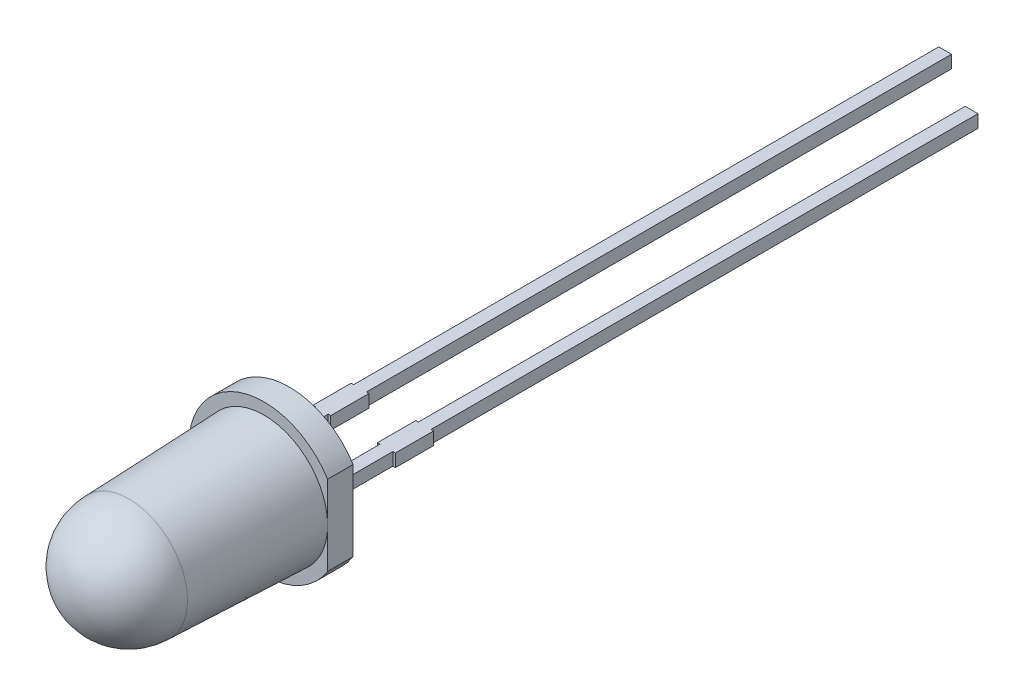
ISO-10303-21;
HEADER;
FILE_DESCRIPTION(('STEP AP214'),'2;1');
FILE_NAME('part.step','',(''),(''),'','','');
FILE_SCHEMA(('AUTOMOTIVE_DESIGN { 1 0 10303 214 1 1 1 1 }'));
ENDSEC;
DATA;
#1=APPLICATION_CONTEXT('core data for automotive mechanical design processes');
#2=APPLICATION_PROTOCOL_DEFINITION('international standard','automotive_design',2000,#1);
#3=PRODUCT_CONTEXT('',#1,'mechanical');
#4=PRODUCT('Part','Part','',(#3));
#5=PRODUCT_RELATED_PRODUCT_CATEGORY('part','',(#4));
#6=PRODUCT_DEFINITION_FORMATION('','',#4);
#7=PRODUCT_DEFINITION_CONTEXT('part definition',#1,'design');
#8=PRODUCT_DEFINITION('design','',#6,#7);
#9=PRODUCT_DEFINITION_SHAPE('','',#8);
#10=(LENGTH_UNIT() NAMED_UNIT(*) SI_UNIT(.MILLI.,.METRE.));
#11=(NAMED_UNIT(*) PLANE_ANGLE_UNIT() SI_UNIT($,.RADIAN.));
#12=(NAMED_UNIT(*) SI_UNIT($,.STERADIAN.) SOLID_ANGLE_UNIT());
#13=UNCERTAINTY_MEASURE_WITH_UNIT(LENGTH_MEASURE(1.E-05),#10,'distance_accuracy_value','');
#14=(GEOMETRIC_REPRESENTATION_CONTEXT(3) GLOBAL_UNCERTAINTY_ASSIGNED_CONTEXT((#13)) GLOBAL_UNIT_ASSIGNED_CONTEXT((#10,
#11,#12)) REPRESENTATION_CONTEXT('',''));
#15=CARTESIAN_POINT('',(0.,0.,0.));
#16=DIRECTION('',(0.,0.,1.));
#17=DIRECTION('',(1.,0.,0.));
#18=AXIS2_PLACEMENT_3D('',#15,#16,#17);
#19=CARTESIAN_POINT('',(0.,0.,6.3));
#20=DIRECTION('',(0.,0.,-1.));
#21=DIRECTION('',(-1.,0.,0.));
#22=AXIS2_PLACEMENT_3D('',#19,#20,#21);
#23=SPHERICAL_SURFACE('',#22,2.3);
#24=CARTESIAN_POINT('',(0.,0.,6.3));
#25=DIRECTION('',(0.,0.,1.));
#26=DIRECTION('',(-1.,0.,0.));
#27=AXIS2_PLACEMENT_3D('',#24,#25,#26);
#28=CIRCLE('',#27,2.3);
#29=CARTESIAN_POINT('',(2.3,0.,6.3));
#30=VERTEX_POINT('',#29);
#31=CARTESIAN_POINT('',(-2.3,0.,6.3));
#32=VERTEX_POINT('',#31);
#33=EDGE_CURVE('E10',#30,#32,#28,.T.);
#34=ORIENTED_EDGE('',*,*,#33,.T.);
#35=CARTESIAN_POINT('',(0.,0.,6.3));
#36=DIRECTION('',(0.,0.,1.));
#37=DIRECTION('',(1.,0.,0.));
#38=AXIS2_PLACEMENT_3D('',#35,#36,#37);
#39=CIRCLE('',#38,2.3);
#40=EDGE_CURVE('E26',#32,#30,#39,.T.);
#41=ORIENTED_EDGE('',*,*,#40,.T.);
#42=EDGE_LOOP('',(#34,#41));
#43=FACE_BOUND('',#42,.T.);
#44=ADVANCED_FACE('F15',(#43),#23,.T.);
#45=CARTESIAN_POINT('',(0.,0.,3.65));
#46=DIRECTION('',(0.,0.,-1.));
#47=DIRECTION('',(1.,0.,0.));
#48=AXIS2_PLACEMENT_3D('',#45,#46,#47);
#49=CONICAL_SURFACE('',#48,2.4,0.0377179524668634);
#50=ORIENTED_EDGE('',*,*,#40,.F.);
#51=ORIENTED_EDGE('',*,*,#33,.F.);
#52=EDGE_LOOP('',(#50,#51));
#53=FACE_BOUND('',#52,.T.);
#54=CARTESIAN_POINT('',(0.,0.,1.));
#55=DIRECTION('',(0.,0.,1.));
#56=DIRECTION('',(1.,0.,0.));
#57=AXIS2_PLACEMENT_3D('',#54,#55,#56);
#58=CIRCLE('',#57,2.5);
#59=CARTESIAN_POINT('',(2.5,0.,1.));
#60=VERTEX_POINT('',#59);
#61=EDGE_CURVE('E400',#60,#60,#58,.T.);
#62=ORIENTED_EDGE('',*,*,#61,.T.);
#63=EDGE_LOOP('',(#62));
#64=FACE_BOUND('',#63,.T.);
#65=ADVANCED_FACE('F965',(#53,#64),#49,.T.);
#66=CARTESIAN_POINT('',(0.,0.,1.));
#67=DIRECTION('',(0.,0.,1.));
#68=DIRECTION('',(1.,0.,0.));
#69=AXIS2_PLACEMENT_3D('',#66,#67,#68);
#70=PLANE('',#69);
#71=ORIENTED_EDGE('',*,*,#61,.F.);
#72=DIRECTION('',(0.,1.,0.));
#73=VECTOR('',#72,1.);
#74=CARTESIAN_POINT('',(2.5,0.,1.));
#75=LINE('',#74,#73);
#76=CARTESIAN_POINT('',(2.5,1.56604597633658,1.));
#77=VERTEX_POINT('',#76);
#78=EDGE_CURVE('E376',#60,#77,#75,.T.);
#79=ORIENTED_EDGE('',*,*,#78,.T.);
#80=CARTESIAN_POINT('',(0.,0.,1.));
#81=DIRECTION('',(0.,0.,1.));
#82=DIRECTION('',(0.847457627118644,0.53086304282596,0.));
#83=AXIS2_PLACEMENT_3D('',#80,#81,#82);
#84=CIRCLE('',#83,2.95);
#85=CARTESIAN_POINT('',(2.5,-1.56604597633658,1.));
#86=VERTEX_POINT('',#85);
#87=EDGE_CURVE('E371',#77,#86,#84,.T.);
#88=ORIENTED_EDGE('',*,*,#87,.T.);
#89=DIRECTION('',(0.,1.,0.));
#90=VECTOR('',#89,1.);
#91=CARTESIAN_POINT('',(2.5,-1.56604597633658,1.));
#92=LINE('',#91,#90);
#93=EDGE_CURVE('E248',#86,#60,#92,.T.);
#94=ORIENTED_EDGE('',*,*,#93,.T.);
#95=EDGE_LOOP('',(#71,#79,#88,#94));
#96=FACE_BOUND('',#95,.T.);
#97=ADVANCED_FACE('F17',(#96),#70,.T.);
#98=CARTESIAN_POINT('',(-1.02,-0.25,-2.54));
#99=DIRECTION('',(0.,0.,1.));
#100=DIRECTION('',(1.,0.,0.));
#101=AXIS2_PLACEMENT_3D('',#98,#99,#100);
#102=PLANE('',#101);
#103=DIRECTION('',(1.,0.,0.));
#104=VECTOR('',#103,1.);
#105=CARTESIAN_POINT('',(-1.02,-0.25,-2.54));
#106=LINE('',#105,#104);
#107=CARTESIAN_POINT('',(-1.02,-0.25,-2.54));
#108=VERTEX_POINT('',#107);
#109=CARTESIAN_POINT('',(-0.92,-0.25,-2.54));
#110=VERTEX_POINT('',#109);
#111=EDGE_CURVE('E353',#108,#110,#106,.T.);
#112=ORIENTED_EDGE('',*,*,#111,.T.);
#113=DIRECTION('',(0.,1.,0.));
#114=VECTOR('',#113,1.);
#115=CARTESIAN_POINT('',(-0.92,-0.25,-2.54));
#116=LINE('',#115,#114);
#117=CARTESIAN_POINT('',(-0.92,0.25,-2.54));
#118=VERTEX_POINT('',#117);
#119=EDGE_CURVE('E347',#110,#118,#116,.T.);
#120=ORIENTED_EDGE('',*,*,#119,.T.);
#121=DIRECTION('',(1.,0.,0.));
#122=VECTOR('',#121,1.);
#123=CARTESIAN_POINT('',(-1.02,0.25,-2.54));
#124=LINE('',#123,#122);
#125=CARTESIAN_POINT('',(-1.02,0.25,-2.54));
#126=VERTEX_POINT('',#125);
#127=EDGE_CURVE('E342',#126,#118,#124,.T.);
#128=ORIENTED_EDGE('',*,*,#127,.F.);
#129=DIRECTION('',(0.,1.,0.));
#130=VECTOR('',#129,1.);
#131=CARTESIAN_POINT('',(-1.02,-0.25,-2.54));
#132=LINE('',#131,#130);
#133=EDGE_CURVE('E19',#108,#126,#132,.T.);
#134=ORIENTED_EDGE('',*,*,#133,.F.);
#135=EDGE_LOOP('',(#112,#120,#128,#134));
#136=FACE_BOUND('',#135,.T.);
#137=ADVANCED_FACE('F1058',(#136),#102,.T.);
#138=CARTESIAN_POINT('',(-0.92,-0.25,-2.54));
#139=DIRECTION('',(1.,0.,0.));
#140=DIRECTION('',(0.,1.,0.));
#141=AXIS2_PLACEMENT_3D('',#138,#139,#140);
#142=PLANE('',#141);
#143=DIRECTION('',(0.,0.,-1.));
#144=VECTOR('',#143,1.);
#145=CARTESIAN_POINT('',(-0.92,-0.25,-2.54));
#146=LINE('',#145,#144);
#147=CARTESIAN_POINT('',(-0.92,-0.25,-4.04));
#148=VERTEX_POINT('',#147);
#149=EDGE_CURVE('E349',#110,#148,#146,.T.);
#150=ORIENTED_EDGE('',*,*,#149,.T.);
#151=DIRECTION('',(0.,1.,0.));
#152=VECTOR('',#151,1.);
#153=CARTESIAN_POINT('',(-0.92,-0.25,-4.04));
#154=LINE('',#153,#152);
#155=CARTESIAN_POINT('',(-0.92,0.25,-4.04));
#156=VERTEX_POINT('',#155);
#157=EDGE_CURVE('E344',#148,#156,#154,.T.);
#158=ORIENTED_EDGE('',*,*,#157,.T.);
#159=DIRECTION('',(0.,0.,-1.));
#160=VECTOR('',#159,1.);
#161=CARTESIAN_POINT('',(-0.92,0.25,-2.54));
#162=LINE('',#161,#160);
#163=EDGE_CURVE('E466',#118,#156,#162,.T.);
#164=ORIENTED_EDGE('',*,*,#163,.F.);
#165=ORIENTED_EDGE('',*,*,#119,.F.);
#166=EDGE_LOOP('',(#150,#158,#164,#165));
#167=FACE_BOUND('',#166,.T.);
#168=ADVANCED_FACE('F842',(#167),#142,.T.);
#169=CARTESIAN_POINT('',(-0.92,-0.25,-4.04));
#170=DIRECTION('',(0.,0.,-1.));
#171=DIRECTION('',(0.,-1.,0.));
#172=AXIS2_PLACEMENT_3D('',#169,#170,#171);
#173=PLANE('',#172);
#174=DIRECTION('',(-1.,0.,0.));
#175=VECTOR('',#174,1.);
#176=CARTESIAN_POINT('',(-0.92,-0.25,-4.04));
#177=LINE('',#176,#175);
#178=CARTESIAN_POINT('',(-1.02,-0.25,-4.04));
#179=VERTEX_POINT('',#178);
#180=EDGE_CURVE('E354',#148,#179,#177,.T.);
#181=ORIENTED_EDGE('',*,*,#180,.T.);
#182=DIRECTION('',(0.,1.,0.));
#183=VECTOR('',#182,1.);
#184=CARTESIAN_POINT('',(-1.02,-0.25,-4.04));
#185=LINE('',#184,#183);
#186=CARTESIAN_POINT('',(-1.02,0.25,-4.04));
#187=VERTEX_POINT('',#186);
#188=EDGE_CURVE('E348',#179,#187,#185,.T.);
#189=ORIENTED_EDGE('',*,*,#188,.T.);
#190=DIRECTION('',(-1.,0.,0.));
#191=VECTOR('',#190,1.);
#192=CARTESIAN_POINT('',(-0.92,0.25,-4.04));
#193=LINE('',#192,#191);
#194=EDGE_CURVE('E470',#156,#187,#193,.T.);
#195=ORIENTED_EDGE('',*,*,#194,.F.);
#196=ORIENTED_EDGE('',*,*,#157,.F.);
#197=EDGE_LOOP('',(#181,#189,#195,#196));
#198=FACE_BOUND('',#197,.T.);
#199=ADVANCED_FACE('F552',(#198),#173,.T.);
#200=CARTESIAN_POINT('',(-1.02,-0.25,-4.04));
#201=DIRECTION('',(1.,0.,0.));
#202=DIRECTION('',(0.,0.,1.));
#203=AXIS2_PLACEMENT_3D('',#200,#201,#202);
#204=PLANE('',#203);
#205=DIRECTION('',(0.,0.,-1.));
#206=VECTOR('',#205,1.);
#207=CARTESIAN_POINT('',(-1.02,-0.25,-4.04));
#208=LINE('',#207,#206);
#209=CARTESIAN_POINT('',(-1.02,-0.25,-27.));
#210=VERTEX_POINT('',#209);
#211=EDGE_CURVE('E321',#179,#210,#208,.T.);
#212=ORIENTED_EDGE('',*,*,#211,.T.);
#213=DIRECTION('',(0.,1.,0.));
#214=VECTOR('',#213,1.);
#215=CARTESIAN_POINT('',(-1.02,-0.25,-27.));
#216=LINE('',#215,#214);
#217=CARTESIAN_POINT('',(-1.02,0.25,-27.));
#218=VERTEX_POINT('',#217);
#219=EDGE_CURVE('E358',#210,#218,#216,.T.);
#220=ORIENTED_EDGE('',*,*,#219,.T.);
#221=DIRECTION('',(0.,0.,-1.));
#222=VECTOR('',#221,1.);
#223=CARTESIAN_POINT('',(-1.02,0.25,-4.04));
#224=LINE('',#223,#222);
#225=EDGE_CURVE('E440',#187,#218,#224,.T.);
#226=ORIENTED_EDGE('',*,*,#225,.F.);
#227=ORIENTED_EDGE('',*,*,#188,.F.);
#228=EDGE_LOOP('',(#212,#220,#226,#227));
#229=FACE_BOUND('',#228,.T.);
#230=ADVANCED_FACE('F558',(#229),#204,.T.);
#231=CARTESIAN_POINT('',(-1.02,-0.25,-27.));
#232=DIRECTION('',(0.,0.,-1.));
#233=DIRECTION('',(0.,-1.,0.));
#234=AXIS2_PLACEMENT_3D('',#231,#232,#233);
#235=PLANE('',#234);
#236=DIRECTION('',(-1.,0.,0.));
#237=VECTOR('',#236,1.);
#238=CARTESIAN_POINT('',(-1.02,-0.25,-27.));
#239=LINE('',#238,#237);
#240=CARTESIAN_POINT('',(-1.52,-0.25,-27.));
#241=VERTEX_POINT('',#240);
#242=EDGE_CURVE('E307',#210,#241,#239,.T.);
#243=ORIENTED_EDGE('',*,*,#242,.T.);
#244=DIRECTION('',(0.,1.,0.));
#245=VECTOR('',#244,1.);
#246=CARTESIAN_POINT('',(-1.52,-0.25,-27.));
#247=LINE('',#246,#245);
#248=CARTESIAN_POINT('',(-1.52,0.25,-27.));
#249=VERTEX_POINT('',#248);
#250=EDGE_CURVE('E355',#241,#249,#247,.T.);
#251=ORIENTED_EDGE('',*,*,#250,.T.);
#252=DIRECTION('',(-1.,0.,0.));
#253=VECTOR('',#252,1.);
#254=CARTESIAN_POINT('',(-1.02,0.25,-27.));
#255=LINE('',#254,#253);
#256=EDGE_CURVE('E436',#218,#249,#255,.T.);
#257=ORIENTED_EDGE('',*,*,#256,.F.);
#258=ORIENTED_EDGE('',*,*,#219,.F.);
#259=EDGE_LOOP('',(#243,#251,#257,#258));
#260=FACE_BOUND('',#259,.T.);
#261=ADVANCED_FACE('F937',(#260),#235,.T.);
#262=CARTESIAN_POINT('',(-1.52,-0.25,-27.));
#263=DIRECTION('',(-1.,0.,0.));
#264=DIRECTION('',(0.,0.,1.));
#265=AXIS2_PLACEMENT_3D('',#262,#263,#264);
#266=PLANE('',#265);
#267=DIRECTION('',(0.,0.,1.));
#268=VECTOR('',#267,1.);
#269=CARTESIAN_POINT('',(-1.52,-0.25,-27.));
#270=LINE('',#269,#268);
#271=CARTESIAN_POINT('',(-1.52,-0.25,-4.04));
#272=VERTEX_POINT('',#271);
#273=EDGE_CURVE('E303',#241,#272,#270,.T.);
#274=ORIENTED_EDGE('',*,*,#273,.T.);
#275=DIRECTION('',(0.,1.,0.));
#276=VECTOR('',#275,1.);
#277=CARTESIAN_POINT('',(-1.52,-0.25,-4.04));
#278=LINE('',#277,#276);
#279=CARTESIAN_POINT('',(-1.52,0.25,-4.04));
#280=VERTEX_POINT('',#279);
#281=EDGE_CURVE('E359',#272,#280,#278,.T.);
#282=ORIENTED_EDGE('',*,*,#281,.T.);
#283=DIRECTION('',(0.,0.,1.));
#284=VECTOR('',#283,1.);
#285=CARTESIAN_POINT('',(-1.52,0.25,-27.));
#286=LINE('',#285,#284);
#287=EDGE_CURVE('E439',#249,#280,#286,.T.);
#288=ORIENTED_EDGE('',*,*,#287,.F.);
#289=ORIENTED_EDGE('',*,*,#250,.F.);
#290=EDGE_LOOP('',(#274,#282,#288,#289));
#291=FACE_BOUND('',#290,.T.);
#292=ADVANCED_FACE('F942',(#291),#266,.T.);
#293=CARTESIAN_POINT('',(-1.52,-0.25,-4.04));
#294=DIRECTION('',(0.,0.,-1.));
#295=DIRECTION('',(0.,-1.,0.));
#296=AXIS2_PLACEMENT_3D('',#293,#294,#295);
#297=PLANE('',#296);
#298=DIRECTION('',(-1.,0.,0.));
#299=VECTOR('',#298,1.);
#300=CARTESIAN_POINT('',(-1.52,-0.25,-4.04));
#301=LINE('',#300,#299);
#302=CARTESIAN_POINT('',(-1.62,-0.25,-4.04));
#303=VERTEX_POINT('',#302);
#304=EDGE_CURVE('E301',#272,#303,#301,.T.);
#305=ORIENTED_EDGE('',*,*,#304,.T.);
#306=DIRECTION('',(0.,1.,0.));
#307=VECTOR('',#306,1.);
#308=CARTESIAN_POINT('',(-1.62,-0.25,-4.04));
#309=LINE('',#308,#307);
#310=CARTESIAN_POINT('',(-1.62,0.25,-4.04));
#311=VERTEX_POINT('',#310);
#312=EDGE_CURVE('E423',#303,#311,#309,.T.);
#313=ORIENTED_EDGE('',*,*,#312,.T.);
#314=DIRECTION('',(-1.,0.,0.));
#315=VECTOR('',#314,1.);
#316=CARTESIAN_POINT('',(-1.52,0.25,-4.04));
#317=LINE('',#316,#315);
#318=EDGE_CURVE('E471',#280,#311,#317,.T.);
#319=ORIENTED_EDGE('',*,*,#318,.F.);
#320=ORIENTED_EDGE('',*,*,#281,.F.);
#321=EDGE_LOOP('',(#305,#313,#319,#320));
#322=FACE_BOUND('',#321,.T.);
#323=ADVANCED_FACE('F1047',(#322),#297,.T.);
#324=CARTESIAN_POINT('',(-1.62,-0.25,-4.04));
#325=DIRECTION('',(-1.,0.,0.));
#326=DIRECTION('',(0.,0.,1.));
#327=AXIS2_PLACEMENT_3D('',#324,#325,#326);
#328=PLANE('',#327);
#329=DIRECTION('',(0.,0.,1.));
#330=VECTOR('',#329,1.);
#331=CARTESIAN_POINT('',(-1.62,-0.25,-4.04));
#332=LINE('',#331,#330);
#333=CARTESIAN_POINT('',(-1.62,-0.25,-2.54));
#334=VERTEX_POINT('',#333);
#335=EDGE_CURVE('E297',#303,#334,#332,.T.);
#336=ORIENTED_EDGE('',*,*,#335,.T.);
#337=DIRECTION('',(0.,1.,0.));
#338=VECTOR('',#337,1.);
#339=CARTESIAN_POINT('',(-1.62,-0.25,-2.54));
#340=LINE('',#339,#338);
#341=CARTESIAN_POINT('',(-1.62,0.25,-2.54));
#342=VERTEX_POINT('',#341);
#343=EDGE_CURVE('E311',#334,#342,#340,.T.);
#344=ORIENTED_EDGE('',*,*,#343,.T.);
#345=DIRECTION('',(0.,0.,1.));
#346=VECTOR('',#345,1.);
#347=CARTESIAN_POINT('',(-1.62,0.25,-4.04));
#348=LINE('',#347,#346);
#349=EDGE_CURVE('E475',#311,#342,#348,.T.);
#350=ORIENTED_EDGE('',*,*,#349,.F.);
#351=ORIENTED_EDGE('',*,*,#312,.F.);
#352=EDGE_LOOP('',(#336,#344,#350,#351));
#353=FACE_BOUND('',#352,.T.);
#354=ADVANCED_FACE('F910',(#353),#328,.T.);
#355=CARTESIAN_POINT('',(-1.62,-0.25,-2.54));
#356=DIRECTION('',(0.,0.,1.));
#357=DIRECTION('',(1.,0.,0.));
#358=AXIS2_PLACEMENT_3D('',#355,#356,#357);
#359=PLANE('',#358);
#360=DIRECTION('',(1.,0.,0.));
#361=VECTOR('',#360,1.);
#362=CARTESIAN_POINT('',(-1.62,-0.25,-2.54));
#363=LINE('',#362,#361);
#364=CARTESIAN_POINT('',(-1.52,-0.25,-2.54));
#365=VERTEX_POINT('',#364);
#366=EDGE_CURVE('E302',#334,#365,#363,.T.);
#367=ORIENTED_EDGE('',*,*,#366,.T.);
#368=DIRECTION('',(0.,1.,0.));
#369=VECTOR('',#368,1.);
#370=CARTESIAN_POINT('',(-1.52,-0.25,-2.54));
#371=LINE('',#370,#369);
#372=CARTESIAN_POINT('',(-1.52,0.25,-2.54));
#373=VERTEX_POINT('',#372);
#374=EDGE_CURVE('E236',#365,#373,#371,.T.);
#375=ORIENTED_EDGE('',*,*,#374,.T.);
#376=DIRECTION('',(1.,0.,0.));
#377=VECTOR('',#376,1.);
#378=CARTESIAN_POINT('',(-1.62,0.25,-2.54));
#379=LINE('',#378,#377);
#380=EDGE_CURVE('E365',#342,#373,#379,.T.);
#381=ORIENTED_EDGE('',*,*,#380,.F.);
#382=ORIENTED_EDGE('',*,*,#343,.F.);
#383=EDGE_LOOP('',(#367,#375,#381,#382));
#384=FACE_BOUND('',#383,.T.);
#385=ADVANCED_FACE('F856',(#384),#359,.T.);
#386=CARTESIAN_POINT('',(1.52,-0.25,-2.54));
#387=DIRECTION('',(0.,0.,1.));
#388=DIRECTION('',(1.,0.,0.));
#389=AXIS2_PLACEMENT_3D('',#386,#387,#388);
#390=PLANE('',#389);
#391=DIRECTION('',(1.,0.,0.));
#392=VECTOR('',#391,1.);
#393=CARTESIAN_POINT('',(1.52,-0.25,-2.54));
#394=LINE('',#393,#392);
#395=CARTESIAN_POINT('',(1.52,-0.25,-2.54));
#396=VERTEX_POINT('',#395);
#397=CARTESIAN_POINT('',(1.62,-0.25,-2.54));
#398=VERTEX_POINT('',#397);
#399=EDGE_CURVE('E456',#396,#398,#394,.T.);
#400=ORIENTED_EDGE('',*,*,#399,.T.);
#401=DIRECTION('',(0.,1.,0.));
#402=VECTOR('',#401,1.);
#403=CARTESIAN_POINT('',(1.62,-0.25,-2.54));
#404=LINE('',#403,#402);
#405=CARTESIAN_POINT('',(1.62,0.25,-2.54));
#406=VERTEX_POINT('',#405);
#407=EDGE_CURVE('E308',#398,#406,#404,.T.);
#408=ORIENTED_EDGE('',*,*,#407,.T.);
#409=DIRECTION('',(1.,0.,0.));
#410=VECTOR('',#409,1.);
#411=CARTESIAN_POINT('',(1.52,0.25,-2.54));
#412=LINE('',#411,#410);
#413=CARTESIAN_POINT('',(1.52,0.25,-2.54));
#414=VERTEX_POINT('',#413);
#415=EDGE_CURVE('E291',#414,#406,#412,.T.);
#416=ORIENTED_EDGE('',*,*,#415,.F.);
#417=DIRECTION('',(0.,1.,0.));
#418=VECTOR('',#417,1.);
#419=CARTESIAN_POINT('',(1.52,-0.25,-2.54));
#420=LINE('',#419,#418);
#421=EDGE_CURVE('E322',#396,#414,#420,.T.);
#422=ORIENTED_EDGE('',*,*,#421,.F.);
#423=EDGE_LOOP('',(#400,#408,#416,#422));
#424=FACE_BOUND('',#423,.T.);
#425=ADVANCED_FACE('F850',(#424),#390,.T.);
#426=CARTESIAN_POINT('',(1.62,-0.25,-2.54));
#427=DIRECTION('',(1.,0.,0.));
#428=DIRECTION('',(0.,1.,0.));
#429=AXIS2_PLACEMENT_3D('',#426,#427,#428);
#430=PLANE('',#429);
#431=DIRECTION('',(0.,0.,-1.));
#432=VECTOR('',#431,1.);
#433=CARTESIAN_POINT('',(1.62,-0.25,-2.54));
#434=LINE('',#433,#432);
#435=CARTESIAN_POINT('',(1.62,-0.25,-4.04));
#436=VERTEX_POINT('',#435);
#437=EDGE_CURVE('E460',#398,#436,#434,.T.);
#438=ORIENTED_EDGE('',*,*,#437,.T.);
#439=DIRECTION('',(0.,1.,0.));
#440=VECTOR('',#439,1.);
#441=CARTESIAN_POINT('',(1.62,-0.25,-4.04));
#442=LINE('',#441,#440);
#443=CARTESIAN_POINT('',(1.62,0.25,-4.04));
#444=VERTEX_POINT('',#443);
#445=EDGE_CURVE('E270',#436,#444,#442,.T.);
#446=ORIENTED_EDGE('',*,*,#445,.T.);
#447=DIRECTION('',(0.,0.,-1.));
#448=VECTOR('',#447,1.);
#449=CARTESIAN_POINT('',(1.62,0.25,-2.54));
#450=LINE('',#449,#448);
#451=EDGE_CURVE('E284',#406,#444,#450,.T.);
#452=ORIENTED_EDGE('',*,*,#451,.F.);
#453=ORIENTED_EDGE('',*,*,#407,.F.);
#454=EDGE_LOOP('',(#438,#446,#452,#453));
#455=FACE_BOUND('',#454,.T.);
#456=ADVANCED_FACE('F855',(#455),#430,.T.);
#457=CARTESIAN_POINT('',(1.62,-0.25,-4.04));
#458=DIRECTION('',(0.,0.,-1.));
#459=DIRECTION('',(0.,-1.,0.));
#460=AXIS2_PLACEMENT_3D('',#457,#458,#459);
#461=PLANE('',#460);
#462=DIRECTION('',(-1.,0.,0.));
#463=VECTOR('',#462,1.);
#464=CARTESIAN_POINT('',(1.62,-0.25,-4.04));
#465=LINE('',#464,#463);
#466=CARTESIAN_POINT('',(1.52,-0.25,-4.04));
#467=VERTEX_POINT('',#466);
#468=EDGE_CURVE('E265',#436,#467,#465,.T.);
#469=ORIENTED_EDGE('',*,*,#468,.T.);
#470=DIRECTION('',(0.,1.,0.));
#471=VECTOR('',#470,1.);
#472=CARTESIAN_POINT('',(1.52,-0.25,-4.04));
#473=LINE('',#472,#471);
#474=CARTESIAN_POINT('',(1.52,0.25,-4.04));
#475=VERTEX_POINT('',#474);
#476=EDGE_CURVE('E257',#467,#475,#473,.T.);
#477=ORIENTED_EDGE('',*,*,#476,.T.);
#478=DIRECTION('',(-1.,0.,0.));
#479=VECTOR('',#478,1.);
#480=CARTESIAN_POINT('',(1.62,0.25,-4.04));
#481=LINE('',#480,#479);
#482=EDGE_CURVE('E262',#444,#475,#481,.T.);
#483=ORIENTED_EDGE('',*,*,#482,.F.);
#484=ORIENTED_EDGE('',*,*,#445,.F.);
#485=EDGE_LOOP('',(#469,#477,#483,#484));
#486=FACE_BOUND('',#485,.T.);
#487=ADVANCED_FACE('F259',(#486),#461,.T.);
#488=CARTESIAN_POINT('',(1.52,-0.25,-4.04));
#489=DIRECTION('',(1.,0.,0.));
#490=DIRECTION('',(0.,0.,1.));
#491=AXIS2_PLACEMENT_3D('',#488,#489,#490);
#492=PLANE('',#491);
#493=DIRECTION('',(0.,0.,-1.));
#494=VECTOR('',#493,1.);
#495=CARTESIAN_POINT('',(1.52,-0.25,-4.04));
#496=LINE('',#495,#494);
#497=CARTESIAN_POINT('',(1.52,-0.25,-25.5));
#498=VERTEX_POINT('',#497);
#499=EDGE_CURVE('E502',#467,#498,#496,.T.);
#500=ORIENTED_EDGE('',*,*,#499,.T.);
#501=DIRECTION('',(0.,1.,0.));
#502=VECTOR('',#501,1.);
#503=CARTESIAN_POINT('',(1.52,-0.25,-25.5));
#504=LINE('',#503,#502);
#505=CARTESIAN_POINT('',(1.52,0.25,-25.5));
#506=VERTEX_POINT('',#505);
#507=EDGE_CURVE('E271',#498,#506,#504,.T.);
#508=ORIENTED_EDGE('',*,*,#507,.T.);
#509=DIRECTION('',(0.,0.,-1.));
#510=VECTOR('',#509,1.);
#511=CARTESIAN_POINT('',(1.52,0.25,-4.04));
#512=LINE('',#511,#510);
#513=EDGE_CURVE('E274',#475,#506,#512,.T.);
#514=ORIENTED_EDGE('',*,*,#513,.F.);
#515=ORIENTED_EDGE('',*,*,#476,.F.);
#516=EDGE_LOOP('',(#500,#508,#514,#515));
#517=FACE_BOUND('',#516,.T.);
#518=ADVANCED_FACE('F275',(#517),#492,.T.);
#519=CARTESIAN_POINT('',(1.52,-0.25,-25.5));
#520=DIRECTION('',(0.,0.,-1.));
#521=DIRECTION('',(0.,-1.,0.));
#522=AXIS2_PLACEMENT_3D('',#519,#520,#521);
#523=PLANE('',#522);
#524=DIRECTION('',(-1.,0.,0.));
#525=VECTOR('',#524,1.);
#526=CARTESIAN_POINT('',(1.52,-0.25,-25.5));
#527=LINE('',#526,#525);
#528=CARTESIAN_POINT('',(1.02,-0.25,-25.5));
#529=VERTEX_POINT('',#528);
#530=EDGE_CURVE('E435',#498,#529,#527,.T.);
#531=ORIENTED_EDGE('',*,*,#530,.T.);
#532=DIRECTION('',(0.,1.,0.));
#533=VECTOR('',#532,1.);
#534=CARTESIAN_POINT('',(1.02,-0.25,-25.5));
#535=LINE('',#534,#533);
#536=CARTESIAN_POINT('',(1.02,0.25,-25.5));
#537=VERTEX_POINT('',#536);
#538=EDGE_CURVE('E501',#529,#537,#535,.T.);
#539=ORIENTED_EDGE('',*,*,#538,.T.);
#540=DIRECTION('',(-1.,0.,0.));
#541=VECTOR('',#540,1.);
#542=CARTESIAN_POINT('',(1.52,0.25,-25.5));
#543=LINE('',#542,#541);
#544=EDGE_CURVE('E279',#506,#537,#543,.T.);
#545=ORIENTED_EDGE('',*,*,#544,.F.);
#546=ORIENTED_EDGE('',*,*,#507,.F.);
#547=EDGE_LOOP('',(#531,#539,#545,#546));
#548=FACE_BOUND('',#547,.T.);
#549=ADVANCED_FACE('F899',(#548),#523,.T.);
#550=CARTESIAN_POINT('',(1.02,-0.25,-25.5));
#551=DIRECTION('',(-1.,0.,0.));
#552=DIRECTION('',(0.,0.,1.));
#553=AXIS2_PLACEMENT_3D('',#550,#551,#552);
#554=PLANE('',#553);
#555=DIRECTION('',(0.,0.,1.));
#556=VECTOR('',#555,1.);
#557=CARTESIAN_POINT('',(1.02,-0.25,-25.5));
#558=LINE('',#557,#556);
#559=CARTESIAN_POINT('',(1.02,-0.25,-4.04));
#560=VERTEX_POINT('',#559);
#561=EDGE_CURVE('E431',#529,#560,#558,.T.);
#562=ORIENTED_EDGE('',*,*,#561,.T.);
#563=DIRECTION('',(0.,1.,0.));
#564=VECTOR('',#563,1.);
#565=CARTESIAN_POINT('',(1.02,-0.25,-4.04));
#566=LINE('',#565,#564);
#567=CARTESIAN_POINT('',(1.02,0.25,-4.04));
#568=VERTEX_POINT('',#567);
#569=EDGE_CURVE('E388',#560,#568,#566,.T.);
#570=ORIENTED_EDGE('',*,*,#569,.T.);
#571=DIRECTION('',(0.,0.,1.));
#572=VECTOR('',#571,1.);
#573=CARTESIAN_POINT('',(1.02,0.25,-25.5));
#574=LINE('',#573,#572);
#575=EDGE_CURVE('E392',#537,#568,#574,.T.);
#576=ORIENTED_EDGE('',*,*,#575,.F.);
#577=ORIENTED_EDGE('',*,*,#538,.F.);
#578=EDGE_LOOP('',(#562,#570,#576,#577));
#579=FACE_BOUND('',#578,.T.);
#580=ADVANCED_FACE('F974',(#579),#554,.T.);
#581=CARTESIAN_POINT('',(1.02,-0.25,-4.04));
#582=DIRECTION('',(0.,0.,-1.));
#583=DIRECTION('',(0.,-1.,0.));
#584=AXIS2_PLACEMENT_3D('',#581,#582,#583);
#585=PLANE('',#584);
#586=DIRECTION('',(-1.,0.,0.));
#587=VECTOR('',#586,1.);
#588=CARTESIAN_POINT('',(1.02,-0.25,-4.04));
#589=LINE('',#588,#587);
#590=CARTESIAN_POINT('',(0.92,-0.25,-4.04));
#591=VERTEX_POINT('',#590);
#592=EDGE_CURVE('E316',#560,#591,#589,.T.);
#593=ORIENTED_EDGE('',*,*,#592,.T.);
#594=DIRECTION('',(0.,1.,0.));
#595=VECTOR('',#594,1.);
#596=CARTESIAN_POINT('',(0.92,-0.25,-4.04));
#597=LINE('',#596,#595);
#598=CARTESIAN_POINT('',(0.92,0.25,-4.04));
#599=VERTEX_POINT('',#598);
#600=EDGE_CURVE('E385',#591,#599,#597,.T.);
#601=ORIENTED_EDGE('',*,*,#600,.T.);
#602=DIRECTION('',(-1.,0.,0.));
#603=VECTOR('',#602,1.);
#604=CARTESIAN_POINT('',(1.02,0.25,-4.04));
#605=LINE('',#604,#603);
#606=EDGE_CURVE('E396',#568,#599,#605,.T.);
#607=ORIENTED_EDGE('',*,*,#606,.F.);
#608=ORIENTED_EDGE('',*,*,#569,.F.);
#609=EDGE_LOOP('',(#593,#601,#607,#608));
#610=FACE_BOUND('',#609,.T.);
#611=ADVANCED_FACE('F871',(#610),#585,.T.);
#612=CARTESIAN_POINT('',(0.92,-0.25,-4.04));
#613=DIRECTION('',(-1.,0.,0.));
#614=DIRECTION('',(0.,0.,1.));
#615=AXIS2_PLACEMENT_3D('',#612,#613,#614);
#616=PLANE('',#615);
#617=DIRECTION('',(0.,0.,1.));
#618=VECTOR('',#617,1.);
#619=CARTESIAN_POINT('',(0.92,-0.25,-4.04));
#620=LINE('',#619,#618);
#621=CARTESIAN_POINT('',(0.92,-0.25,-2.54));
#622=VERTEX_POINT('',#621);
#623=EDGE_CURVE('E312',#591,#622,#620,.T.);
#624=ORIENTED_EDGE('',*,*,#623,.T.);
#625=DIRECTION('',(0.,1.,0.));
#626=VECTOR('',#625,1.);
#627=CARTESIAN_POINT('',(0.92,-0.25,-2.54));
#628=LINE('',#627,#626);
#629=CARTESIAN_POINT('',(0.92,0.25,-2.54));
#630=VERTEX_POINT('',#629);
#631=EDGE_CURVE('E389',#622,#630,#628,.T.);
#632=ORIENTED_EDGE('',*,*,#631,.T.);
#633=DIRECTION('',(0.,0.,1.));
#634=VECTOR('',#633,1.);
#635=CARTESIAN_POINT('',(0.92,0.25,-4.04));
#636=LINE('',#635,#634);
#637=EDGE_CURVE('E295',#599,#630,#636,.T.);
#638=ORIENTED_EDGE('',*,*,#637,.F.);
#639=ORIENTED_EDGE('',*,*,#600,.F.);
#640=EDGE_LOOP('',(#624,#632,#638,#639));
#641=FACE_BOUND('',#640,.T.);
#642=ADVANCED_FACE('F865',(#641),#616,.T.);
#643=CARTESIAN_POINT('',(0.92,-0.25,-2.54));
#644=DIRECTION('',(0.,0.,1.));
#645=DIRECTION('',(1.,0.,0.));
#646=AXIS2_PLACEMENT_3D('',#643,#644,#645);
#647=PLANE('',#646);
#648=DIRECTION('',(1.,0.,0.));
#649=VECTOR('',#648,1.);
#650=CARTESIAN_POINT('',(0.92,-0.25,-2.54));
#651=LINE('',#650,#649);
#652=CARTESIAN_POINT('',(1.02,-0.25,-2.54));
#653=VERTEX_POINT('',#652);
#654=EDGE_CURVE('E317',#622,#653,#651,.T.);
#655=ORIENTED_EDGE('',*,*,#654,.T.);
#656=DIRECTION('',(0.,1.,0.));
#657=VECTOR('',#656,1.);
#658=CARTESIAN_POINT('',(1.02,-0.25,-2.54));
#659=LINE('',#658,#657);
#660=CARTESIAN_POINT('',(1.02,0.25,-2.54));
#661=VERTEX_POINT('',#660);
#662=EDGE_CURVE('E325',#653,#661,#659,.T.);
#663=ORIENTED_EDGE('',*,*,#662,.T.);
#664=DIRECTION('',(1.,0.,0.));
#665=VECTOR('',#664,1.);
#666=CARTESIAN_POINT('',(0.92,0.25,-2.54));
#667=LINE('',#666,#665);
#668=EDGE_CURVE('E496',#630,#661,#667,.T.);
#669=ORIENTED_EDGE('',*,*,#668,.F.);
#670=ORIENTED_EDGE('',*,*,#631,.F.);
#671=EDGE_LOOP('',(#655,#663,#669,#670));
#672=FACE_BOUND('',#671,.T.);
#673=ADVANCED_FACE('F870',(#672),#647,.T.);
#674=CARTESIAN_POINT('',(2.5,-1.56604597633658,0.));
#675=DIRECTION('',(1.,0.,0.));
#676=DIRECTION('',(0.,1.,0.));
#677=AXIS2_PLACEMENT_3D('',#674,#675,#676);
#678=PLANE('',#677);
#679=DIRECTION('',(0.,1.,0.));
#680=VECTOR('',#679,1.);
#681=CARTESIAN_POINT('',(2.5,-1.56604597633658,0.));
#682=LINE('',#681,#680);
#683=CARTESIAN_POINT('',(2.5,-1.56604597633658,0.));
#684=VERTEX_POINT('',#683);
#685=CARTESIAN_POINT('',(2.5,1.56604597633658,0.));
#686=VERTEX_POINT('',#685);
#687=EDGE_CURVE('E329',#684,#686,#682,.T.);
#688=ORIENTED_EDGE('',*,*,#687,.T.);
#689=DIRECTION('',(0.,0.,1.));
#690=VECTOR('',#689,1.);
#691=CARTESIAN_POINT('',(2.5,1.56604597633658,0.));
#692=LINE('',#691,#690);
#693=EDGE_CURVE('E374',#686,#77,#692,.T.);
#694=ORIENTED_EDGE('',*,*,#693,.T.);
#695=ORIENTED_EDGE('',*,*,#78,.F.);
#696=ORIENTED_EDGE('',*,*,#93,.F.);
#697=DIRECTION('',(0.,0.,1.));
#698=VECTOR('',#697,1.);
#699=CARTESIAN_POINT('',(2.5,-1.56604597633658,0.));
#700=LINE('',#699,#698);
#701=EDGE_CURVE('E375',#684,#86,#700,.T.);
#702=ORIENTED_EDGE('',*,*,#701,.F.);
#703=EDGE_LOOP('',(#688,#694,#695,#696,#702));
#704=FACE_BOUND('',#703,.T.);
#705=ADVANCED_FACE('F950',(#704),#678,.T.);
#706=CARTESIAN_POINT('',(0.,0.,0.));
#707=DIRECTION('',(0.,0.,1.));
#708=DIRECTION('',(0.847457627118644,0.53086304282596,0.));
#709=AXIS2_PLACEMENT_3D('',#706,#707,#708);
#710=CYLINDRICAL_SURFACE('',#709,2.95);
#711=CARTESIAN_POINT('',(0.,0.,0.));
#712=DIRECTION('',(0.,0.,1.));
#713=DIRECTION('',(0.847457627118644,0.53086304282596,0.));
#714=AXIS2_PLACEMENT_3D('',#711,#712,#713);
#715=CIRCLE('',#714,2.95);
#716=EDGE_CURVE('E334',#686,#684,#715,.T.);
#717=ORIENTED_EDGE('',*,*,#716,.T.);
#718=ORIENTED_EDGE('',*,*,#701,.T.);
#719=ORIENTED_EDGE('',*,*,#87,.F.);
#720=ORIENTED_EDGE('',*,*,#693,.F.);
#721=EDGE_LOOP('',(#717,#718,#719,#720));
#722=FACE_BOUND('',#721,.T.);
#723=ADVANCED_FACE('F886',(#722),#710,.T.);
#724=CARTESIAN_POINT('',(-1.52,-0.25,-2.54));
#725=DIRECTION('',(-1.,0.,0.));
#726=DIRECTION('',(0.,0.,1.));
#727=AXIS2_PLACEMENT_3D('',#724,#725,#726);
#728=PLANE('',#727);
#729=DIRECTION('',(0.,1.,0.));
#730=VECTOR('',#729,1.);
#731=CARTESIAN_POINT('',(-1.52,0.25,0.));
#732=LINE('',#731,#730);
#733=CARTESIAN_POINT('',(-1.52,-0.25,0.));
#734=VERTEX_POINT('',#733);
#735=CARTESIAN_POINT('',(-1.52,0.25,0.));
#736=VERTEX_POINT('',#735);
#737=EDGE_CURVE('E333',#734,#736,#732,.T.);
#738=ORIENTED_EDGE('',*,*,#737,.T.);
#739=DIRECTION('',(0.,0.,1.));
#740=VECTOR('',#739,1.);
#741=CARTESIAN_POINT('',(-1.52,0.25,-2.54));
#742=LINE('',#741,#740);
#743=EDGE_CURVE('E362',#373,#736,#742,.T.);
#744=ORIENTED_EDGE('',*,*,#743,.F.);
#745=ORIENTED_EDGE('',*,*,#374,.F.);
#746=DIRECTION('',(0.,0.,1.));
#747=VECTOR('',#746,1.);
#748=CARTESIAN_POINT('',(-1.52,-0.25,-2.54));
#749=LINE('',#748,#747);
#750=EDGE_CURVE('E326',#365,#734,#749,.T.);
#751=ORIENTED_EDGE('',*,*,#750,.T.);
#752=EDGE_LOOP('',(#738,#744,#745,#751));
#753=FACE_BOUND('',#752,.T.);
#754=ADVANCED_FACE('F880',(#753),#728,.T.);
#755=CARTESIAN_POINT('',(-1.02,-0.25,0.));
#756=DIRECTION('',(1.,0.,0.));
#757=DIRECTION('',(0.,1.,0.));
#758=AXIS2_PLACEMENT_3D('',#755,#756,#757);
#759=PLANE('',#758);
#760=DIRECTION('',(0.,-1.,0.));
#761=VECTOR('',#760,1.);
#762=CARTESIAN_POINT('',(-1.02,-0.25,0.));
#763=LINE('',#762,#761);
#764=CARTESIAN_POINT('',(-1.02,0.25,0.));
#765=VERTEX_POINT('',#764);
#766=CARTESIAN_POINT('',(-1.02,-0.25,0.));
#767=VERTEX_POINT('',#766);
#768=EDGE_CURVE('E409',#765,#767,#763,.T.);
#769=ORIENTED_EDGE('',*,*,#768,.T.);
#770=DIRECTION('',(0.,0.,-1.));
#771=VECTOR('',#770,1.);
#772=CARTESIAN_POINT('',(-1.02,-0.25,0.));
#773=LINE('',#772,#771);
#774=EDGE_CURVE('E343',#767,#108,#773,.T.);
#775=ORIENTED_EDGE('',*,*,#774,.T.);
#776=ORIENTED_EDGE('',*,*,#133,.T.);
#777=DIRECTION('',(0.,0.,-1.));
#778=VECTOR('',#777,1.);
#779=CARTESIAN_POINT('',(-1.02,0.25,0.));
#780=LINE('',#779,#778);
#781=EDGE_CURVE('E338',#765,#126,#780,.T.);
#782=ORIENTED_EDGE('',*,*,#781,.F.);
#783=EDGE_LOOP('',(#769,#775,#776,#782));
#784=FACE_BOUND('',#783,.T.);
#785=ADVANCED_FACE('F885',(#784),#759,.T.);
#786=CARTESIAN_POINT('',(0.,0.25,0.));
#787=DIRECTION('',(0.,1.,0.));
#788=DIRECTION('',(1.,0.,0.));
#789=AXIS2_PLACEMENT_3D('',#786,#787,#788);
#790=PLANE('',#789);
#791=DIRECTION('',(1.,0.,0.));
#792=VECTOR('',#791,1.);
#793=CARTESIAN_POINT('',(-1.02,0.25,0.));
#794=LINE('',#793,#792);
#795=EDGE_CURVE('E405',#736,#765,#794,.T.);
#796=ORIENTED_EDGE('',*,*,#795,.T.);
#797=ORIENTED_EDGE('',*,*,#781,.T.);
#798=ORIENTED_EDGE('',*,*,#127,.T.);
#799=ORIENTED_EDGE('',*,*,#163,.T.);
#800=ORIENTED_EDGE('',*,*,#194,.T.);
#801=ORIENTED_EDGE('',*,*,#225,.T.);
#802=ORIENTED_EDGE('',*,*,#256,.T.);
#803=ORIENTED_EDGE('',*,*,#287,.T.);
#804=ORIENTED_EDGE('',*,*,#318,.T.);
#805=ORIENTED_EDGE('',*,*,#349,.T.);
#806=ORIENTED_EDGE('',*,*,#380,.T.);
#807=ORIENTED_EDGE('',*,*,#743,.T.);
#808=EDGE_LOOP('',(#796,#797,#798,#799,#800,#801,#802,#803,#804,#805,#806,#807));
#809=FACE_BOUND('',#808,.T.);
#810=ADVANCED_FACE('F561',(#809),#790,.T.);
#811=CARTESIAN_POINT('',(0.,-0.25,0.));
#812=DIRECTION('',(0.,1.,0.));
#813=DIRECTION('',(1.,0.,0.));
#814=AXIS2_PLACEMENT_3D('',#811,#812,#813);
#815=PLANE('',#814);
#816=DIRECTION('',(-1.,0.,0.));
#817=VECTOR('',#816,1.);
#818=CARTESIAN_POINT('',(-1.02,-0.25,0.));
#819=LINE('',#818,#817);
#820=EDGE_CURVE('E452',#767,#734,#819,.T.);
#821=ORIENTED_EDGE('',*,*,#820,.T.);
#822=ORIENTED_EDGE('',*,*,#750,.F.);
#823=ORIENTED_EDGE('',*,*,#366,.F.);
#824=ORIENTED_EDGE('',*,*,#335,.F.);
#825=ORIENTED_EDGE('',*,*,#304,.F.);
#826=ORIENTED_EDGE('',*,*,#273,.F.);
#827=ORIENTED_EDGE('',*,*,#242,.F.);
#828=ORIENTED_EDGE('',*,*,#211,.F.);
#829=ORIENTED_EDGE('',*,*,#180,.F.);
#830=ORIENTED_EDGE('',*,*,#149,.F.);
#831=ORIENTED_EDGE('',*,*,#111,.F.);
#832=ORIENTED_EDGE('',*,*,#774,.F.);
#833=EDGE_LOOP('',(#821,#822,#823,#824,#825,#826,#827,#828,#829,#830,#831,#832));
#834=FACE_BOUND('',#833,.T.);
#835=ADVANCED_FACE('F917',(#834),#815,.F.);
#836=CARTESIAN_POINT('',(1.02,-0.25,-2.54));
#837=DIRECTION('',(-1.,0.,0.));
#838=DIRECTION('',(0.,0.,1.));
#839=AXIS2_PLACEMENT_3D('',#836,#837,#838);
#840=PLANE('',#839);
#841=DIRECTION('',(0.,1.,0.));
#842=VECTOR('',#841,1.);
#843=CARTESIAN_POINT('',(1.02,0.25,0.));
#844=LINE('',#843,#842);
#845=CARTESIAN_POINT('',(1.02,-0.25,0.));
#846=VERTEX_POINT('',#845);
#847=CARTESIAN_POINT('',(1.02,0.25,0.));
#848=VERTEX_POINT('',#847);
#849=EDGE_CURVE('E370',#846,#848,#844,.T.);
#850=ORIENTED_EDGE('',*,*,#849,.T.);
#851=DIRECTION('',(0.,0.,1.));
#852=VECTOR('',#851,1.);
#853=CARTESIAN_POINT('',(1.02,0.25,-2.54));
#854=LINE('',#853,#852);
#855=EDGE_CURVE('E125',#661,#848,#854,.T.);
#856=ORIENTED_EDGE('',*,*,#855,.F.);
#857=ORIENTED_EDGE('',*,*,#662,.F.);
#858=DIRECTION('',(0.,0.,1.));
#859=VECTOR('',#858,1.);
#860=CARTESIAN_POINT('',(1.02,-0.25,-2.54));
#861=LINE('',#860,#859);
#862=EDGE_CURVE('E136',#653,#846,#861,.T.);
#863=ORIENTED_EDGE('',*,*,#862,.T.);
#864=EDGE_LOOP('',(#850,#856,#857,#863));
#865=FACE_BOUND('',#864,.T.);
#866=ADVANCED_FACE('F815',(#865),#840,.T.);
#867=CARTESIAN_POINT('',(1.52,-0.25,0.));
#868=DIRECTION('',(1.,0.,0.));
#869=DIRECTION('',(0.,1.,0.));
#870=AXIS2_PLACEMENT_3D('',#867,#868,#869);
#871=PLANE('',#870);
#872=DIRECTION('',(0.,-1.,0.));
#873=VECTOR('',#872,1.);
#874=CARTESIAN_POINT('',(1.52,-0.25,0.));
#875=LINE('',#874,#873);
#876=CARTESIAN_POINT('',(1.52,0.25,0.));
#877=VERTEX_POINT('',#876);
#878=CARTESIAN_POINT('',(1.52,-0.25,0.));
#879=VERTEX_POINT('',#878);
#880=EDGE_CURVE('E369',#877,#879,#875,.T.);
#881=ORIENTED_EDGE('',*,*,#880,.T.);
#882=DIRECTION('',(0.,0.,-1.));
#883=VECTOR('',#882,1.);
#884=CARTESIAN_POINT('',(1.52,-0.25,0.));
#885=LINE('',#884,#883);
#886=EDGE_CURVE('E414',#879,#396,#885,.T.);
#887=ORIENTED_EDGE('',*,*,#886,.T.);
#888=ORIENTED_EDGE('',*,*,#421,.T.);
#889=DIRECTION('',(0.,0.,-1.));
#890=VECTOR('',#889,1.);
#891=CARTESIAN_POINT('',(1.52,0.25,0.));
#892=LINE('',#891,#890);
#893=EDGE_CURVE('E410',#877,#414,#892,.T.);
#894=ORIENTED_EDGE('',*,*,#893,.F.);
#895=EDGE_LOOP('',(#881,#887,#888,#894));
#896=FACE_BOUND('',#895,.T.);
#897=ADVANCED_FACE('F809',(#896),#871,.T.);
#898=CARTESIAN_POINT('',(0.,0.25,0.));
#899=DIRECTION('',(0.,1.,0.));
#900=DIRECTION('',(1.,0.,0.));
#901=AXIS2_PLACEMENT_3D('',#898,#899,#900);
#902=PLANE('',#901);
#903=DIRECTION('',(1.,0.,0.));
#904=VECTOR('',#903,1.);
#905=CARTESIAN_POINT('',(1.52,0.25,0.));
#906=LINE('',#905,#904);
#907=EDGE_CURVE('E381',#848,#877,#906,.T.);
#908=ORIENTED_EDGE('',*,*,#907,.T.);
#909=ORIENTED_EDGE('',*,*,#893,.T.);
#910=ORIENTED_EDGE('',*,*,#415,.T.);
#911=ORIENTED_EDGE('',*,*,#451,.T.);
#912=ORIENTED_EDGE('',*,*,#482,.T.);
#913=ORIENTED_EDGE('',*,*,#513,.T.);
#914=ORIENTED_EDGE('',*,*,#544,.T.);
#915=ORIENTED_EDGE('',*,*,#575,.T.);
#916=ORIENTED_EDGE('',*,*,#606,.T.);
#917=ORIENTED_EDGE('',*,*,#637,.T.);
#918=ORIENTED_EDGE('',*,*,#668,.T.);
#919=ORIENTED_EDGE('',*,*,#855,.T.);
#920=EDGE_LOOP('',(#908,#909,#910,#911,#912,#913,#914,#915,#916,#917,#918,#919));
#921=FACE_BOUND('',#920,.T.);
#922=ADVANCED_FACE('F281',(#921),#902,.T.);
#923=CARTESIAN_POINT('',(0.,-0.25,0.));
#924=DIRECTION('',(0.,1.,0.));
#925=DIRECTION('',(1.,0.,0.));
#926=AXIS2_PLACEMENT_3D('',#923,#924,#925);
#927=PLANE('',#926);
#928=DIRECTION('',(-1.,0.,0.));
#929=VECTOR('',#928,1.);
#930=CARTESIAN_POINT('',(1.52,-0.25,0.));
#931=LINE('',#930,#929);
#932=EDGE_CURVE('E366',#879,#846,#931,.T.);
#933=ORIENTED_EDGE('',*,*,#932,.T.);
#934=ORIENTED_EDGE('',*,*,#862,.F.);
#935=ORIENTED_EDGE('',*,*,#654,.F.);
#936=ORIENTED_EDGE('',*,*,#623,.F.);
#937=ORIENTED_EDGE('',*,*,#592,.F.);
#938=ORIENTED_EDGE('',*,*,#561,.F.);
#939=ORIENTED_EDGE('',*,*,#530,.F.);
#940=ORIENTED_EDGE('',*,*,#499,.F.);
#941=ORIENTED_EDGE('',*,*,#468,.F.);
#942=ORIENTED_EDGE('',*,*,#437,.F.);
#943=ORIENTED_EDGE('',*,*,#399,.F.);
#944=ORIENTED_EDGE('',*,*,#886,.F.);
#945=EDGE_LOOP('',(#933,#934,#935,#936,#937,#938,#939,#940,#941,#942,#943,#944));
#946=FACE_BOUND('',#945,.T.);
#947=ADVANCED_FACE('F825',(#946),#927,.F.);
#948=CARTESIAN_POINT('',(0.,0.,0.));
#949=DIRECTION('',(0.,0.,1.));
#950=DIRECTION('',(1.,0.,0.));
#951=AXIS2_PLACEMENT_3D('',#948,#949,#950);
#952=PLANE('',#951);
#953=ORIENTED_EDGE('',*,*,#849,.F.);
#954=ORIENTED_EDGE('',*,*,#932,.F.);
#955=ORIENTED_EDGE('',*,*,#880,.F.);
#956=ORIENTED_EDGE('',*,*,#907,.F.);
#957=EDGE_LOOP('',(#953,#954,#955,#956));
#958=FACE_BOUND('',#957,.T.);
#959=ORIENTED_EDGE('',*,*,#737,.F.);
#960=ORIENTED_EDGE('',*,*,#820,.F.);
#961=ORIENTED_EDGE('',*,*,#768,.F.);
#962=ORIENTED_EDGE('',*,*,#795,.F.);
#963=EDGE_LOOP('',(#959,#960,#961,#962));
#964=FACE_BOUND('',#963,.T.);
#965=ORIENTED_EDGE('',*,*,#716,.F.);
#966=ORIENTED_EDGE('',*,*,#687,.F.);
#967=EDGE_LOOP('',(#965,#966));
#968=FACE_BOUND('',#967,.T.);
#969=ADVANCED_FACE('F830',(#958,#964,#968),#952,.F.);
#970=CLOSED_SHELL('',(#44,#65,#97,#137,#168,#199,#230,#261,#292,#323,#354,#385,#425,#456,#487,
#518,#549,#580,#611,#642,#673,#705,#723,#754,#785,#810,#835,#866,#897,#922,#947,#969));
#971=MANIFOLD_SOLID_BREP('B1',#970);
#972=ADVANCED_BREP_SHAPE_REPRESENTATION('',(#18,#971),#14);
#973=SHAPE_DEFINITION_REPRESENTATION(#9,#972);
ENDSEC;
END-ISO-10303-21;
